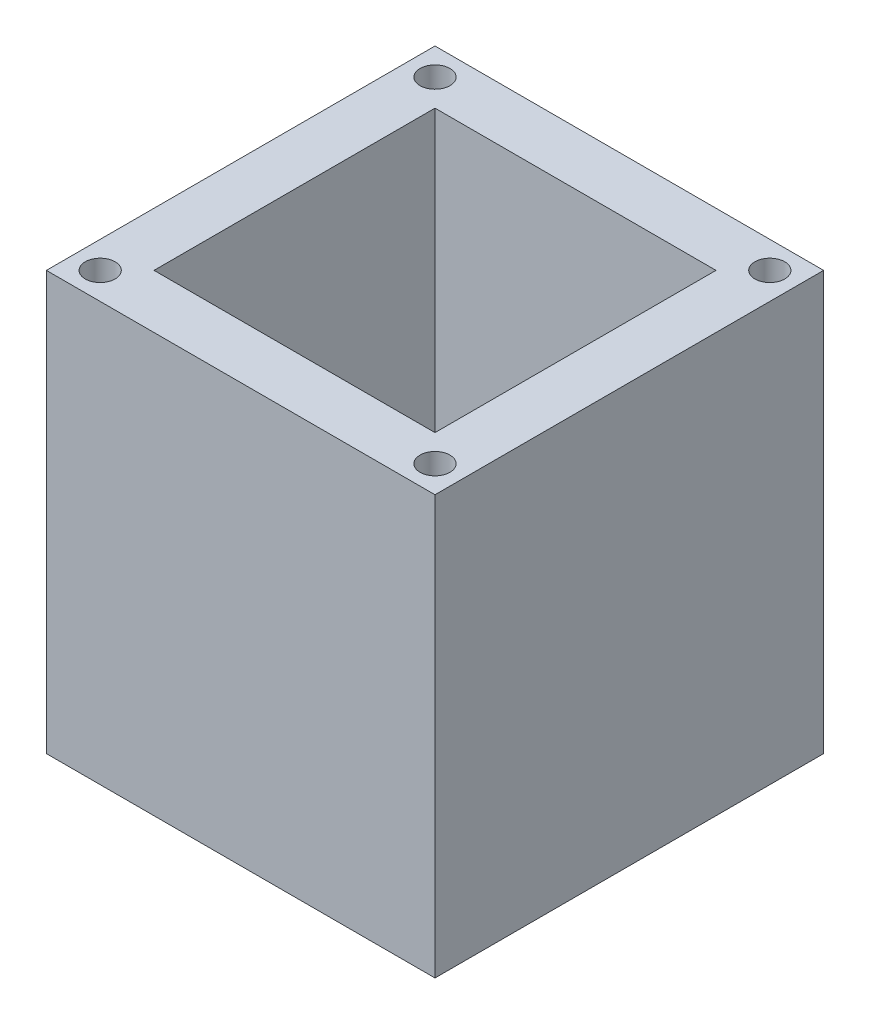
ISO-10303-21;
HEADER;
FILE_DESCRIPTION(('STEP AP214'),'2;1');
FILE_NAME('part.step','',(''),(''),'','','');
FILE_SCHEMA(('AUTOMOTIVE_DESIGN { 1 0 10303 214 1 1 1 1 }'));
ENDSEC;
DATA;
#1=APPLICATION_CONTEXT('core data for automotive mechanical design processes');
#2=APPLICATION_PROTOCOL_DEFINITION('international standard','automotive_design',2000,#1);
#3=PRODUCT_CONTEXT('',#1,'mechanical');
#4=PRODUCT('Part','Part','',(#3));
#5=PRODUCT_RELATED_PRODUCT_CATEGORY('part','',(#4));
#6=PRODUCT_DEFINITION_FORMATION('','',#4);
#7=PRODUCT_DEFINITION_CONTEXT('part definition',#1,'design');
#8=PRODUCT_DEFINITION('design','',#6,#7);
#9=PRODUCT_DEFINITION_SHAPE('','',#8);
#10=(LENGTH_UNIT() NAMED_UNIT(*) SI_UNIT(.MILLI.,.METRE.));
#11=(NAMED_UNIT(*) PLANE_ANGLE_UNIT() SI_UNIT($,.RADIAN.));
#12=(NAMED_UNIT(*) SI_UNIT($,.STERADIAN.) SOLID_ANGLE_UNIT());
#13=UNCERTAINTY_MEASURE_WITH_UNIT(LENGTH_MEASURE(1.E-05),#10,'distance_accuracy_value','');
#14=(GEOMETRIC_REPRESENTATION_CONTEXT(3) GLOBAL_UNCERTAINTY_ASSIGNED_CONTEXT((#13)) GLOBAL_UNIT_ASSIGNED_CONTEXT((#10,
#11,#12)) REPRESENTATION_CONTEXT('',''));
#15=CARTESIAN_POINT('',(0.,0.,0.));
#16=DIRECTION('',(0.,0.,1.));
#17=DIRECTION('',(1.,0.,0.));
#18=AXIS2_PLACEMENT_3D('',#15,#16,#17);
#19=CARTESIAN_POINT('',(0.,70.,0.));
#20=DIRECTION('',(1.,0.,0.));
#21=DIRECTION('',(0.,0.,-1.));
#22=AXIS2_PLACEMENT_3D('',#19,#20,#21);
#23=PLANE('',#22);
#24=DIRECTION('',(0.,0.,1.));
#25=VECTOR('',#24,1.);
#26=CARTESIAN_POINT('',(0.,0.,0.));
#27=LINE('',#26,#25);
#28=CARTESIAN_POINT('',(0.,0.,-65.));
#29=VERTEX_POINT('',#28);
#30=CARTESIAN_POINT('',(0.,0.,0.));
#31=VERTEX_POINT('',#30);
#32=EDGE_CURVE('E197',#29,#31,#27,.T.);
#33=ORIENTED_EDGE('',*,*,#32,.T.);
#34=DIRECTION('',(0.,-1.,0.));
#35=VECTOR('',#34,1.);
#36=CARTESIAN_POINT('',(0.,70.,0.));
#37=LINE('',#36,#35);
#38=CARTESIAN_POINT('',(0.,70.,0.));
#39=VERTEX_POINT('',#38);
#40=EDGE_CURVE('E244',#39,#31,#37,.T.);
#41=ORIENTED_EDGE('',*,*,#40,.F.);
#42=DIRECTION('',(0.,0.,1.));
#43=VECTOR('',#42,1.);
#44=CARTESIAN_POINT('',(0.,70.,0.));
#45=LINE('',#44,#43);
#46=CARTESIAN_POINT('',(0.,70.,-65.));
#47=VERTEX_POINT('',#46);
#48=EDGE_CURVE('E207',#47,#39,#45,.T.);
#49=ORIENTED_EDGE('',*,*,#48,.F.);
#50=DIRECTION('',(0.,-1.,0.));
#51=VECTOR('',#50,1.);
#52=CARTESIAN_POINT('',(0.,70.,-65.));
#53=LINE('',#52,#51);
#54=EDGE_CURVE('E221',#47,#29,#53,.T.);
#55=ORIENTED_EDGE('',*,*,#54,.T.);
#56=EDGE_LOOP('',(#33,#41,#49,#55));
#57=FACE_BOUND('',#56,.T.);
#58=ADVANCED_FACE('F39',(#57),#23,.F.);
#59=CARTESIAN_POINT('',(0.,70.,0.));
#60=DIRECTION('',(0.,0.,-1.));
#61=DIRECTION('',(-1.,0.,0.));
#62=AXIS2_PLACEMENT_3D('',#59,#60,#61);
#63=PLANE('',#62);
#64=DIRECTION('',(1.,0.,0.));
#65=VECTOR('',#64,1.);
#66=CARTESIAN_POINT('',(0.,0.,0.));
#67=LINE('',#66,#65);
#68=CARTESIAN_POINT('',(65.,0.,0.));
#69=VERTEX_POINT('',#68);
#70=EDGE_CURVE('E225',#31,#69,#67,.T.);
#71=ORIENTED_EDGE('',*,*,#70,.T.);
#72=DIRECTION('',(0.,-1.,0.));
#73=VECTOR('',#72,1.);
#74=CARTESIAN_POINT('',(65.,70.,0.));
#75=LINE('',#74,#73);
#76=CARTESIAN_POINT('',(65.,70.,0.));
#77=VERTEX_POINT('',#76);
#78=EDGE_CURVE('E240',#77,#69,#75,.T.);
#79=ORIENTED_EDGE('',*,*,#78,.F.);
#80=DIRECTION('',(1.,0.,0.));
#81=VECTOR('',#80,1.);
#82=CARTESIAN_POINT('',(0.,70.,0.));
#83=LINE('',#82,#81);
#84=EDGE_CURVE('E211',#39,#77,#83,.T.);
#85=ORIENTED_EDGE('',*,*,#84,.F.);
#86=ORIENTED_EDGE('',*,*,#40,.T.);
#87=EDGE_LOOP('',(#71,#79,#85,#86));
#88=FACE_BOUND('',#87,.T.);
#89=ADVANCED_FACE('F326',(#88),#63,.F.);
#90=CARTESIAN_POINT('',(65.,70.,0.));
#91=DIRECTION('',(-1.,0.,0.));
#92=DIRECTION('',(0.,0.,1.));
#93=AXIS2_PLACEMENT_3D('',#90,#91,#92);
#94=PLANE('',#93);
#95=DIRECTION('',(0.,0.,-1.));
#96=VECTOR('',#95,1.);
#97=CARTESIAN_POINT('',(65.,0.,0.));
#98=LINE('',#97,#96);
#99=CARTESIAN_POINT('',(65.,0.,-65.));
#100=VERTEX_POINT('',#99);
#101=EDGE_CURVE('E228',#69,#100,#98,.T.);
#102=ORIENTED_EDGE('',*,*,#101,.T.);
#103=DIRECTION('',(0.,-1.,0.));
#104=VECTOR('',#103,1.);
#105=CARTESIAN_POINT('',(65.,70.,-65.));
#106=LINE('',#105,#104);
#107=CARTESIAN_POINT('',(65.,70.,-65.));
#108=VERTEX_POINT('',#107);
#109=EDGE_CURVE('E236',#108,#100,#106,.T.);
#110=ORIENTED_EDGE('',*,*,#109,.F.);
#111=DIRECTION('',(0.,0.,-1.));
#112=VECTOR('',#111,1.);
#113=CARTESIAN_POINT('',(65.,70.,0.));
#114=LINE('',#113,#112);
#115=EDGE_CURVE('E215',#77,#108,#114,.T.);
#116=ORIENTED_EDGE('',*,*,#115,.F.);
#117=ORIENTED_EDGE('',*,*,#78,.T.);
#118=EDGE_LOOP('',(#102,#110,#116,#117));
#119=FACE_BOUND('',#118,.T.);
#120=ADVANCED_FACE('F331',(#119),#94,.F.);
#121=CARTESIAN_POINT('',(0.,70.,-65.));
#122=DIRECTION('',(0.,0.,1.));
#123=DIRECTION('',(1.,0.,0.));
#124=AXIS2_PLACEMENT_3D('',#121,#122,#123);
#125=PLANE('',#124);
#126=DIRECTION('',(-1.,0.,0.));
#127=VECTOR('',#126,1.);
#128=CARTESIAN_POINT('',(0.,0.,-65.));
#129=LINE('',#128,#127);
#130=EDGE_CURVE('E212',#100,#29,#129,.T.);
#131=ORIENTED_EDGE('',*,*,#130,.T.);
#132=ORIENTED_EDGE('',*,*,#54,.F.);
#133=DIRECTION('',(-1.,0.,0.));
#134=VECTOR('',#133,1.);
#135=CARTESIAN_POINT('',(0.,70.,-65.));
#136=LINE('',#135,#134);
#137=EDGE_CURVE('E218',#108,#47,#136,.T.);
#138=ORIENTED_EDGE('',*,*,#137,.F.);
#139=ORIENTED_EDGE('',*,*,#109,.T.);
#140=EDGE_LOOP('',(#131,#132,#138,#139));
#141=FACE_BOUND('',#140,.T.);
#142=ADVANCED_FACE('F309',(#141),#125,.F.);
#143=CARTESIAN_POINT('',(0.,70.,0.));
#144=DIRECTION('',(0.,-1.,0.));
#145=DIRECTION('',(0.,0.,-1.));
#146=AXIS2_PLACEMENT_3D('',#143,#144,#145);
#147=PLANE('',#146);
#148=CARTESIAN_POINT('',(4.5,70.,-4.5));
#149=DIRECTION('',(0.,1.,0.));
#150=DIRECTION('',(0.,0.,1.));
#151=AXIS2_PLACEMENT_3D('',#148,#149,#150);
#152=CIRCLE('',#151,2.5);
#153=CARTESIAN_POINT('',(4.5,70.,-2.));
#154=VERTEX_POINT('',#153);
#155=EDGE_CURVE('E273',#154,#154,#152,.T.);
#156=ORIENTED_EDGE('',*,*,#155,.F.);
#157=EDGE_LOOP('',(#156));
#158=FACE_BOUND('',#157,.T.);
#159=CARTESIAN_POINT('',(60.5,70.,-4.5));
#160=DIRECTION('',(0.,1.,0.));
#161=DIRECTION('',(0.,0.,1.));
#162=AXIS2_PLACEMENT_3D('',#159,#160,#161);
#163=CIRCLE('',#162,2.5);
#164=CARTESIAN_POINT('',(60.5,70.,-2.));
#165=VERTEX_POINT('',#164);
#166=EDGE_CURVE('E281',#165,#165,#163,.T.);
#167=ORIENTED_EDGE('',*,*,#166,.F.);
#168=EDGE_LOOP('',(#167));
#169=FACE_BOUND('',#168,.T.);
#170=CARTESIAN_POINT('',(60.5,70.,-60.5));
#171=DIRECTION('',(0.,1.,0.));
#172=DIRECTION('',(0.,0.,1.));
#173=AXIS2_PLACEMENT_3D('',#170,#171,#172);
#174=CIRCLE('',#173,2.5);
#175=CARTESIAN_POINT('',(60.5,70.,-58.));
#176=VERTEX_POINT('',#175);
#177=EDGE_CURVE('E289',#176,#176,#174,.T.);
#178=ORIENTED_EDGE('',*,*,#177,.F.);
#179=EDGE_LOOP('',(#178));
#180=FACE_BOUND('',#179,.T.);
#181=CARTESIAN_POINT('',(4.5,70.,-60.5));
#182=DIRECTION('',(0.,1.,0.));
#183=DIRECTION('',(0.,0.,1.));
#184=AXIS2_PLACEMENT_3D('',#181,#182,#183);
#185=CIRCLE('',#184,2.5);
#186=CARTESIAN_POINT('',(4.5,70.,-58.));
#187=VERTEX_POINT('',#186);
#188=EDGE_CURVE('E266',#187,#187,#185,.T.);
#189=ORIENTED_EDGE('',*,*,#188,.F.);
#190=EDGE_LOOP('',(#189));
#191=FACE_BOUND('',#190,.T.);
#192=DIRECTION('',(1.,0.,0.));
#193=VECTOR('',#192,1.);
#194=CARTESIAN_POINT('',(9.00000000000001,70.,-9.));
#195=LINE('',#194,#193);
#196=CARTESIAN_POINT('',(9.00000000000001,70.,-9.));
#197=VERTEX_POINT('',#196);
#198=CARTESIAN_POINT('',(56.,70.,-9.));
#199=VERTEX_POINT('',#198);
#200=EDGE_CURVE('E183',#197,#199,#195,.T.);
#201=ORIENTED_EDGE('',*,*,#200,.F.);
#202=DIRECTION('',(0.,0.,1.));
#203=VECTOR('',#202,1.);
#204=CARTESIAN_POINT('',(9.,70.,-56.));
#205=LINE('',#204,#203);
#206=CARTESIAN_POINT('',(9.,70.,-56.));
#207=VERTEX_POINT('',#206);
#208=EDGE_CURVE('E158',#207,#197,#205,.T.);
#209=ORIENTED_EDGE('',*,*,#208,.F.);
#210=DIRECTION('',(-1.,0.,0.));
#211=VECTOR('',#210,1.);
#212=CARTESIAN_POINT('',(9.,70.,-56.));
#213=LINE('',#212,#211);
#214=CARTESIAN_POINT('',(56.,70.,-56.));
#215=VERTEX_POINT('',#214);
#216=EDGE_CURVE('E168',#215,#207,#213,.T.);
#217=ORIENTED_EDGE('',*,*,#216,.F.);
#218=DIRECTION('',(0.,0.,-1.));
#219=VECTOR('',#218,1.);
#220=CARTESIAN_POINT('',(56.,70.,-56.));
#221=LINE('',#220,#219);
#222=EDGE_CURVE('E187',#199,#215,#221,.T.);
#223=ORIENTED_EDGE('',*,*,#222,.F.);
#224=EDGE_LOOP('',(#201,#209,#217,#223));
#225=FACE_BOUND('',#224,.T.);
#226=ORIENTED_EDGE('',*,*,#48,.T.);
#227=ORIENTED_EDGE('',*,*,#84,.T.);
#228=ORIENTED_EDGE('',*,*,#115,.T.);
#229=ORIENTED_EDGE('',*,*,#137,.T.);
#230=EDGE_LOOP('',(#226,#227,#228,#229));
#231=FACE_BOUND('',#230,.T.);
#232=ADVANCED_FACE('F306',(#158,#169,#180,#191,#225,#231),#147,.F.);
#233=CARTESIAN_POINT('',(0.,0.,0.));
#234=DIRECTION('',(0.,-1.,0.));
#235=DIRECTION('',(0.,0.,-1.));
#236=AXIS2_PLACEMENT_3D('',#233,#234,#235);
#237=PLANE('',#236);
#238=DIRECTION('',(0.,0.,1.));
#239=VECTOR('',#238,1.);
#240=CARTESIAN_POINT('',(48.5,0.,-48.5));
#241=LINE('',#240,#239);
#242=CARTESIAN_POINT('',(48.5,0.,-48.5));
#243=VERTEX_POINT('',#242);
#244=CARTESIAN_POINT('',(48.5,0.,-16.5));
#245=VERTEX_POINT('',#244);
#246=EDGE_CURVE('E54',#243,#245,#241,.T.);
#247=ORIENTED_EDGE('',*,*,#246,.F.);
#248=DIRECTION('',(1.,0.,0.));
#249=VECTOR('',#248,1.);
#250=CARTESIAN_POINT('',(48.5,0.,-48.5));
#251=LINE('',#250,#249);
#252=CARTESIAN_POINT('',(16.5,0.,-48.5));
#253=VERTEX_POINT('',#252);
#254=EDGE_CURVE('E148',#253,#243,#251,.T.);
#255=ORIENTED_EDGE('',*,*,#254,.F.);
#256=DIRECTION('',(0.,0.,-1.));
#257=VECTOR('',#256,1.);
#258=CARTESIAN_POINT('',(16.5,0.,-48.5));
#259=LINE('',#258,#257);
#260=CARTESIAN_POINT('',(16.5,0.,-16.5));
#261=VERTEX_POINT('',#260);
#262=EDGE_CURVE('E130',#261,#253,#259,.T.);
#263=ORIENTED_EDGE('',*,*,#262,.F.);
#264=DIRECTION('',(-1.,0.,0.));
#265=VECTOR('',#264,1.);
#266=CARTESIAN_POINT('',(48.5,0.,-16.5));
#267=LINE('',#266,#265);
#268=EDGE_CURVE('E140',#245,#261,#267,.T.);
#269=ORIENTED_EDGE('',*,*,#268,.F.);
#270=EDGE_LOOP('',(#247,#255,#263,#269));
#271=FACE_BOUND('',#270,.T.);
#272=ORIENTED_EDGE('',*,*,#32,.F.);
#273=ORIENTED_EDGE('',*,*,#130,.F.);
#274=ORIENTED_EDGE('',*,*,#101,.F.);
#275=ORIENTED_EDGE('',*,*,#70,.F.);
#276=EDGE_LOOP('',(#272,#273,#274,#275));
#277=FACE_BOUND('',#276,.T.);
#278=ADVANCED_FACE('F145',(#271,#277),#237,.T.);
#279=CARTESIAN_POINT('',(9.,10.,-56.));
#280=DIRECTION('',(-1.,0.,0.));
#281=DIRECTION('',(0.,0.,1.));
#282=AXIS2_PLACEMENT_3D('',#279,#280,#281);
#283=PLANE('',#282);
#284=ORIENTED_EDGE('',*,*,#208,.T.);
#285=DIRECTION('',(0.,1.,0.));
#286=VECTOR('',#285,1.);
#287=CARTESIAN_POINT('',(9.00000000000001,10.,-9.));
#288=LINE('',#287,#286);
#289=CARTESIAN_POINT('',(9.00000000000001,10.,-9.));
#290=VERTEX_POINT('',#289);
#291=EDGE_CURVE('E180',#290,#197,#288,.T.);
#292=ORIENTED_EDGE('',*,*,#291,.F.);
#293=DIRECTION('',(0.,0.,1.));
#294=VECTOR('',#293,1.);
#295=CARTESIAN_POINT('',(9.,10.,-56.));
#296=LINE('',#295,#294);
#297=CARTESIAN_POINT('',(9.,10.,-56.));
#298=VERTEX_POINT('',#297);
#299=EDGE_CURVE('E163',#298,#290,#296,.T.);
#300=ORIENTED_EDGE('',*,*,#299,.F.);
#301=DIRECTION('',(0.,1.,0.));
#302=VECTOR('',#301,1.);
#303=CARTESIAN_POINT('',(9.,10.,-56.));
#304=LINE('',#303,#302);
#305=EDGE_CURVE('E194',#298,#207,#304,.T.);
#306=ORIENTED_EDGE('',*,*,#305,.T.);
#307=EDGE_LOOP('',(#284,#292,#300,#306));
#308=FACE_BOUND('',#307,.T.);
#309=ADVANCED_FACE('F335',(#308),#283,.F.);
#310=CARTESIAN_POINT('',(9.,10.,-56.));
#311=DIRECTION('',(0.,0.,-1.));
#312=DIRECTION('',(-1.,0.,0.));
#313=AXIS2_PLACEMENT_3D('',#310,#311,#312);
#314=PLANE('',#313);
#315=ORIENTED_EDGE('',*,*,#216,.T.);
#316=ORIENTED_EDGE('',*,*,#305,.F.);
#317=DIRECTION('',(-1.,0.,0.));
#318=VECTOR('',#317,1.);
#319=CARTESIAN_POINT('',(9.,10.,-56.));
#320=LINE('',#319,#318);
#321=CARTESIAN_POINT('',(56.,10.,-56.));
#322=VERTEX_POINT('',#321);
#323=EDGE_CURVE('E176',#322,#298,#320,.T.);
#324=ORIENTED_EDGE('',*,*,#323,.F.);
#325=DIRECTION('',(0.,1.,0.));
#326=VECTOR('',#325,1.);
#327=CARTESIAN_POINT('',(56.,10.,-56.));
#328=LINE('',#327,#326);
#329=EDGE_CURVE('E198',#322,#215,#328,.T.);
#330=ORIENTED_EDGE('',*,*,#329,.T.);
#331=EDGE_LOOP('',(#315,#316,#324,#330));
#332=FACE_BOUND('',#331,.T.);
#333=ADVANCED_FACE('F340',(#332),#314,.F.);
#334=CARTESIAN_POINT('',(56.,10.,-56.));
#335=DIRECTION('',(1.,0.,0.));
#336=DIRECTION('',(0.,0.,-1.));
#337=AXIS2_PLACEMENT_3D('',#334,#335,#336);
#338=PLANE('',#337);
#339=ORIENTED_EDGE('',*,*,#222,.T.);
#340=ORIENTED_EDGE('',*,*,#329,.F.);
#341=DIRECTION('',(0.,0.,-1.));
#342=VECTOR('',#341,1.);
#343=CARTESIAN_POINT('',(56.,10.,-56.));
#344=LINE('',#343,#342);
#345=CARTESIAN_POINT('',(56.,10.,-9.));
#346=VERTEX_POINT('',#345);
#347=EDGE_CURVE('E172',#346,#322,#344,.T.);
#348=ORIENTED_EDGE('',*,*,#347,.F.);
#349=DIRECTION('',(0.,1.,0.));
#350=VECTOR('',#349,1.);
#351=CARTESIAN_POINT('',(56.,10.,-9.));
#352=LINE('',#351,#350);
#353=EDGE_CURVE('E201',#346,#199,#352,.T.);
#354=ORIENTED_EDGE('',*,*,#353,.T.);
#355=EDGE_LOOP('',(#339,#340,#348,#354));
#356=FACE_BOUND('',#355,.T.);
#357=ADVANCED_FACE('F458',(#356),#338,.F.);
#358=CARTESIAN_POINT('',(9.00000000000001,10.,-9.));
#359=DIRECTION('',(0.,0.,1.));
#360=DIRECTION('',(1.,0.,0.));
#361=AXIS2_PLACEMENT_3D('',#358,#359,#360);
#362=PLANE('',#361);
#363=ORIENTED_EDGE('',*,*,#200,.T.);
#364=ORIENTED_EDGE('',*,*,#353,.F.);
#365=DIRECTION('',(1.,0.,0.));
#366=VECTOR('',#365,1.);
#367=CARTESIAN_POINT('',(9.00000000000001,10.,-9.));
#368=LINE('',#367,#366);
#369=EDGE_CURVE('E167',#290,#346,#368,.T.);
#370=ORIENTED_EDGE('',*,*,#369,.F.);
#371=ORIENTED_EDGE('',*,*,#291,.T.);
#372=EDGE_LOOP('',(#363,#364,#370,#371));
#373=FACE_BOUND('',#372,.T.);
#374=ADVANCED_FACE('F455',(#373),#362,.F.);
#375=CARTESIAN_POINT('',(0.,10.,0.));
#376=DIRECTION('',(0.,1.,0.));
#377=DIRECTION('',(0.,0.,1.));
#378=AXIS2_PLACEMENT_3D('',#375,#376,#377);
#379=PLANE('',#378);
#380=DIRECTION('',(0.,0.,-1.));
#381=VECTOR('',#380,1.);
#382=CARTESIAN_POINT('',(48.5,10.,0.));
#383=LINE('',#382,#381);
#384=CARTESIAN_POINT('',(48.5,10.,-16.5));
#385=VERTEX_POINT('',#384);
#386=CARTESIAN_POINT('',(48.5,10.,-48.5));
#387=VERTEX_POINT('',#386);
#388=EDGE_CURVE('E11',#385,#387,#383,.T.);
#389=ORIENTED_EDGE('',*,*,#388,.F.);
#390=DIRECTION('',(1.,0.,0.));
#391=VECTOR('',#390,1.);
#392=CARTESIAN_POINT('',(0.,10.,-16.5));
#393=LINE('',#392,#391);
#394=CARTESIAN_POINT('',(16.5,10.,-16.5));
#395=VERTEX_POINT('',#394);
#396=EDGE_CURVE('E248',#395,#385,#393,.T.);
#397=ORIENTED_EDGE('',*,*,#396,.F.);
#398=DIRECTION('',(0.,0.,1.));
#399=VECTOR('',#398,1.);
#400=CARTESIAN_POINT('',(16.5,10.,0.));
#401=LINE('',#400,#399);
#402=CARTESIAN_POINT('',(16.5,10.,-48.5));
#403=VERTEX_POINT('',#402);
#404=EDGE_CURVE('E133',#403,#395,#401,.T.);
#405=ORIENTED_EDGE('',*,*,#404,.F.);
#406=DIRECTION('',(-1.,0.,0.));
#407=VECTOR('',#406,1.);
#408=CARTESIAN_POINT('',(0.,10.,-48.5));
#409=LINE('',#408,#407);
#410=EDGE_CURVE('E47',#387,#403,#409,.T.);
#411=ORIENTED_EDGE('',*,*,#410,.F.);
#412=EDGE_LOOP('',(#389,#397,#405,#411));
#413=FACE_BOUND('',#412,.T.);
#414=ORIENTED_EDGE('',*,*,#299,.T.);
#415=ORIENTED_EDGE('',*,*,#369,.T.);
#416=ORIENTED_EDGE('',*,*,#347,.T.);
#417=ORIENTED_EDGE('',*,*,#323,.T.);
#418=EDGE_LOOP('',(#414,#415,#416,#417));
#419=FACE_BOUND('',#418,.T.);
#420=ADVANCED_FACE('F259',(#413,#419),#379,.T.);
#421=CARTESIAN_POINT('',(48.5,60.,-48.5));
#422=DIRECTION('',(1.,0.,0.));
#423=DIRECTION('',(0.,0.,-1.));
#424=AXIS2_PLACEMENT_3D('',#421,#422,#423);
#425=PLANE('',#424);
#426=ORIENTED_EDGE('',*,*,#388,.T.);
#427=DIRECTION('',(0.,-1.,0.));
#428=VECTOR('',#427,1.);
#429=CARTESIAN_POINT('',(48.5,60.,-48.5));
#430=LINE('',#429,#428);
#431=EDGE_CURVE('E155',#387,#243,#430,.T.);
#432=ORIENTED_EDGE('',*,*,#431,.T.);
#433=ORIENTED_EDGE('',*,*,#246,.T.);
#434=DIRECTION('',(0.,-1.,0.));
#435=VECTOR('',#434,1.);
#436=CARTESIAN_POINT('',(48.5,60.,-16.5));
#437=LINE('',#436,#435);
#438=EDGE_CURVE('E137',#385,#245,#437,.T.);
#439=ORIENTED_EDGE('',*,*,#438,.F.);
#440=EDGE_LOOP('',(#426,#432,#433,#439));
#441=FACE_BOUND('',#440,.T.);
#442=ADVANCED_FACE('F261',(#441),#425,.F.);
#443=CARTESIAN_POINT('',(48.5,60.,-48.5));
#444=DIRECTION('',(0.,0.,-1.));
#445=DIRECTION('',(-1.,0.,0.));
#446=AXIS2_PLACEMENT_3D('',#443,#444,#445);
#447=PLANE('',#446);
#448=ORIENTED_EDGE('',*,*,#410,.T.);
#449=DIRECTION('',(0.,-1.,0.));
#450=VECTOR('',#449,1.);
#451=CARTESIAN_POINT('',(16.5,60.,-48.5));
#452=LINE('',#451,#450);
#453=EDGE_CURVE('E136',#403,#253,#452,.T.);
#454=ORIENTED_EDGE('',*,*,#453,.T.);
#455=ORIENTED_EDGE('',*,*,#254,.T.);
#456=ORIENTED_EDGE('',*,*,#431,.F.);
#457=EDGE_LOOP('',(#448,#454,#455,#456));
#458=FACE_BOUND('',#457,.T.);
#459=ADVANCED_FACE('F256',(#458),#447,.F.);
#460=CARTESIAN_POINT('',(16.5,60.,-48.5));
#461=DIRECTION('',(-1.,0.,0.));
#462=DIRECTION('',(0.,0.,1.));
#463=AXIS2_PLACEMENT_3D('',#460,#461,#462);
#464=PLANE('',#463);
#465=ORIENTED_EDGE('',*,*,#404,.T.);
#466=DIRECTION('',(0.,-1.,0.));
#467=VECTOR('',#466,1.);
#468=CARTESIAN_POINT('',(16.5,60.,-16.5));
#469=LINE('',#468,#467);
#470=EDGE_CURVE('E62',#395,#261,#469,.T.);
#471=ORIENTED_EDGE('',*,*,#470,.T.);
#472=ORIENTED_EDGE('',*,*,#262,.T.);
#473=ORIENTED_EDGE('',*,*,#453,.F.);
#474=EDGE_LOOP('',(#465,#471,#472,#473));
#475=FACE_BOUND('',#474,.T.);
#476=ADVANCED_FACE('F127',(#475),#464,.F.);
#477=CARTESIAN_POINT('',(48.5,60.,-16.5));
#478=DIRECTION('',(0.,0.,1.));
#479=DIRECTION('',(1.,0.,0.));
#480=AXIS2_PLACEMENT_3D('',#477,#478,#479);
#481=PLANE('',#480);
#482=ORIENTED_EDGE('',*,*,#396,.T.);
#483=ORIENTED_EDGE('',*,*,#438,.T.);
#484=ORIENTED_EDGE('',*,*,#268,.T.);
#485=ORIENTED_EDGE('',*,*,#470,.F.);
#486=EDGE_LOOP('',(#482,#483,#484,#485));
#487=FACE_BOUND('',#486,.T.);
#488=ADVANCED_FACE('F141',(#487),#481,.F.);
#489=CARTESIAN_POINT('',(4.5,55.,-60.5));
#490=DIRECTION('',(0.,1.,0.));
#491=DIRECTION('',(0.,0.,1.));
#492=AXIS2_PLACEMENT_3D('',#489,#490,#491);
#493=CYLINDRICAL_SURFACE('',#492,2.5);
#494=CARTESIAN_POINT('',(4.5,55.,-60.5));
#495=DIRECTION('',(0.,1.,0.));
#496=DIRECTION('',(0.,0.,1.));
#497=AXIS2_PLACEMENT_3D('',#494,#495,#496);
#498=CIRCLE('',#497,2.5);
#499=CARTESIAN_POINT('',(4.5,55.,-58.));
#500=VERTEX_POINT('',#499);
#501=EDGE_CURVE('E263',#500,#500,#498,.T.);
#502=ORIENTED_EDGE('',*,*,#501,.F.);
#503=EDGE_LOOP('',(#502));
#504=FACE_BOUND('',#503,.T.);
#505=ORIENTED_EDGE('',*,*,#188,.T.);
#506=EDGE_LOOP('',(#505));
#507=FACE_BOUND('',#506,.T.);
#508=ADVANCED_FACE('F373',(#504,#507),#493,.F.);
#509=CARTESIAN_POINT('',(4.5,55.,-60.5));
#510=DIRECTION('',(0.,1.,0.));
#511=DIRECTION('',(0.,0.,1.));
#512=AXIS2_PLACEMENT_3D('',#509,#510,#511);
#513=PLANE('',#512);
#514=ORIENTED_EDGE('',*,*,#501,.T.);
#515=EDGE_LOOP('',(#514));
#516=FACE_BOUND('',#515,.T.);
#517=ADVANCED_FACE('F302',(#516),#513,.T.);
#518=CARTESIAN_POINT('',(60.5,55.,-60.5));
#519=DIRECTION('',(0.,1.,0.));
#520=DIRECTION('',(0.,0.,1.));
#521=AXIS2_PLACEMENT_3D('',#518,#519,#520);
#522=CYLINDRICAL_SURFACE('',#521,2.5);
#523=CARTESIAN_POINT('',(60.5,55.,-60.5));
#524=DIRECTION('',(0.,1.,0.));
#525=DIRECTION('',(0.,0.,1.));
#526=AXIS2_PLACEMENT_3D('',#523,#524,#525);
#527=CIRCLE('',#526,2.5);
#528=CARTESIAN_POINT('',(60.5,55.,-58.));
#529=VERTEX_POINT('',#528);
#530=EDGE_CURVE('E271',#529,#529,#527,.T.);
#531=ORIENTED_EDGE('',*,*,#530,.F.);
#532=EDGE_LOOP('',(#531));
#533=FACE_BOUND('',#532,.T.);
#534=ORIENTED_EDGE('',*,*,#177,.T.);
#535=EDGE_LOOP('',(#534));
#536=FACE_BOUND('',#535,.T.);
#537=ADVANCED_FACE('F299',(#533,#536),#522,.F.);
#538=CARTESIAN_POINT('',(60.5,55.,-60.5));
#539=DIRECTION('',(0.,1.,0.));
#540=DIRECTION('',(0.,0.,1.));
#541=AXIS2_PLACEMENT_3D('',#538,#539,#540);
#542=PLANE('',#541);
#543=ORIENTED_EDGE('',*,*,#530,.T.);
#544=EDGE_LOOP('',(#543));
#545=FACE_BOUND('',#544,.T.);
#546=ADVANCED_FACE('F297',(#545),#542,.T.);
#547=CARTESIAN_POINT('',(60.5,55.,-4.5));
#548=DIRECTION('',(0.,1.,0.));
#549=DIRECTION('',(0.,0.,1.));
#550=AXIS2_PLACEMENT_3D('',#547,#548,#549);
#551=CYLINDRICAL_SURFACE('',#550,2.5);
#552=CARTESIAN_POINT('',(60.5,55.,-4.5));
#553=DIRECTION('',(0.,1.,0.));
#554=DIRECTION('',(0.,0.,1.));
#555=AXIS2_PLACEMENT_3D('',#552,#553,#554);
#556=CIRCLE('',#555,2.5);
#557=CARTESIAN_POINT('',(60.5,55.,-2.));
#558=VERTEX_POINT('',#557);
#559=EDGE_CURVE('E285',#558,#558,#556,.T.);
#560=ORIENTED_EDGE('',*,*,#559,.F.);
#561=EDGE_LOOP('',(#560));
#562=FACE_BOUND('',#561,.T.);
#563=ORIENTED_EDGE('',*,*,#166,.T.);
#564=EDGE_LOOP('',(#563));
#565=FACE_BOUND('',#564,.T.);
#566=ADVANCED_FACE('F402',(#562,#565),#551,.F.);
#567=CARTESIAN_POINT('',(60.5,55.,-4.5));
#568=DIRECTION('',(0.,1.,0.));
#569=DIRECTION('',(0.,0.,1.));
#570=AXIS2_PLACEMENT_3D('',#567,#568,#569);
#571=PLANE('',#570);
#572=ORIENTED_EDGE('',*,*,#559,.T.);
#573=EDGE_LOOP('',(#572));
#574=FACE_BOUND('',#573,.T.);
#575=ADVANCED_FACE('F411',(#574),#571,.T.);
#576=CARTESIAN_POINT('',(4.5,55.,-4.5));
#577=DIRECTION('',(0.,1.,0.));
#578=DIRECTION('',(0.,0.,1.));
#579=AXIS2_PLACEMENT_3D('',#576,#577,#578);
#580=CYLINDRICAL_SURFACE('',#579,2.5);
#581=CARTESIAN_POINT('',(4.5,55.,-4.5));
#582=DIRECTION('',(0.,1.,0.));
#583=DIRECTION('',(0.,0.,1.));
#584=AXIS2_PLACEMENT_3D('',#581,#582,#583);
#585=CIRCLE('',#584,2.5);
#586=CARTESIAN_POINT('',(4.5,55.,-2.));
#587=VERTEX_POINT('',#586);
#588=EDGE_CURVE('E277',#587,#587,#585,.T.);
#589=ORIENTED_EDGE('',*,*,#588,.F.);
#590=EDGE_LOOP('',(#589));
#591=FACE_BOUND('',#590,.T.);
#592=ORIENTED_EDGE('',*,*,#155,.T.);
#593=EDGE_LOOP('',(#592));
#594=FACE_BOUND('',#593,.T.);
#595=ADVANCED_FACE('F421',(#591,#594),#580,.F.);
#596=CARTESIAN_POINT('',(4.5,55.,-4.5));
#597=DIRECTION('',(0.,1.,0.));
#598=DIRECTION('',(0.,0.,1.));
#599=AXIS2_PLACEMENT_3D('',#596,#597,#598);
#600=PLANE('',#599);
#601=ORIENTED_EDGE('',*,*,#588,.T.);
#602=EDGE_LOOP('',(#601));
#603=FACE_BOUND('',#602,.T.);
#604=ADVANCED_FACE('F431',(#603),#600,.T.);
#605=CLOSED_SHELL('',(#58,#89,#120,#142,#232,#278,#309,#333,#357,#374,#420,#442,#459,#476,#488,
#508,#517,#537,#546,#566,#575,#595,#604));
#606=MANIFOLD_SOLID_BREP('B2',#605);
#607=ADVANCED_BREP_SHAPE_REPRESENTATION('',(#18,#606),#14);
#608=SHAPE_DEFINITION_REPRESENTATION(#9,#607);
ENDSEC;
END-ISO-10303-21;
